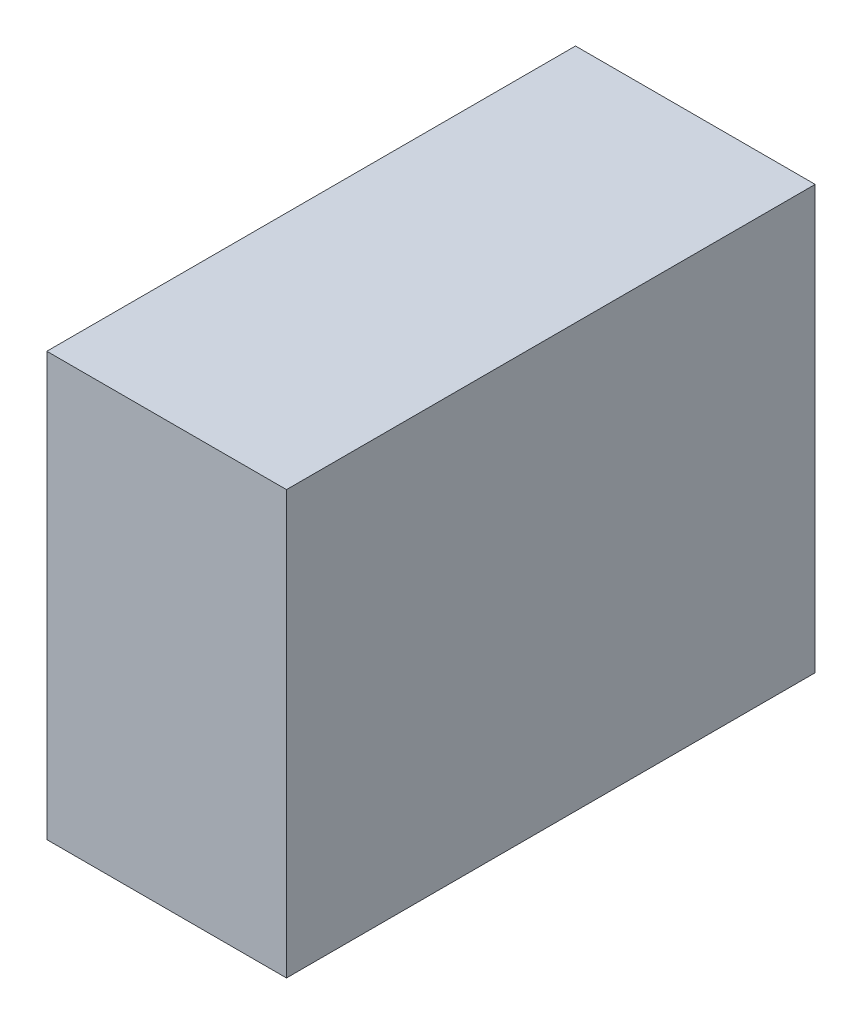
ISO-10303-21;
HEADER;
FILE_DESCRIPTION(('STEP AP214'),'2;1');
FILE_NAME('part.step','',(''),(''),'','','');
FILE_SCHEMA(('AUTOMOTIVE_DESIGN { 1 0 10303 214 1 1 1 1 }'));
ENDSEC;
DATA;
#1=APPLICATION_CONTEXT('core data for automotive mechanical design processes');
#2=APPLICATION_PROTOCOL_DEFINITION('international standard','automotive_design',2000,#1);
#3=PRODUCT_CONTEXT('',#1,'mechanical');
#4=PRODUCT('Part','Part','',(#3));
#5=PRODUCT_RELATED_PRODUCT_CATEGORY('part','',(#4));
#6=PRODUCT_DEFINITION_FORMATION('','',#4);
#7=PRODUCT_DEFINITION_CONTEXT('part definition',#1,'design');
#8=PRODUCT_DEFINITION('design','',#6,#7);
#9=PRODUCT_DEFINITION_SHAPE('','',#8);
#10=(LENGTH_UNIT() NAMED_UNIT(*) SI_UNIT(.MILLI.,.METRE.));
#11=(NAMED_UNIT(*) PLANE_ANGLE_UNIT() SI_UNIT($,.RADIAN.));
#12=(NAMED_UNIT(*) SI_UNIT($,.STERADIAN.) SOLID_ANGLE_UNIT());
#13=UNCERTAINTY_MEASURE_WITH_UNIT(LENGTH_MEASURE(1.E-05),#10,'distance_accuracy_value','');
#14=(GEOMETRIC_REPRESENTATION_CONTEXT(3) GLOBAL_UNCERTAINTY_ASSIGNED_CONTEXT((#13)) GLOBAL_UNIT_ASSIGNED_CONTEXT((#10,
#11,#12)) REPRESENTATION_CONTEXT('',''));
#15=CARTESIAN_POINT('',(0.,0.,0.));
#16=DIRECTION('',(0.,0.,1.));
#17=DIRECTION('',(1.,0.,0.));
#18=AXIS2_PLACEMENT_3D('',#15,#16,#17);
#19=CARTESIAN_POINT('',(0.,0.,150.));
#20=DIRECTION('',(1.,0.,0.));
#21=DIRECTION('',(0.,1.,0.));
#22=AXIS2_PLACEMENT_3D('',#19,#20,#21);
#23=PLANE('',#22);
#24=DIRECTION('',(0.,-1.,0.));
#25=VECTOR('',#24,1.);
#26=CARTESIAN_POINT('',(0.,0.,0.));
#27=LINE('',#26,#25);
#28=CARTESIAN_POINT('',(0.,120.,0.));
#29=VERTEX_POINT('',#28);
#30=CARTESIAN_POINT('',(0.,0.,0.));
#31=VERTEX_POINT('',#30);
#32=EDGE_CURVE('E96',#29,#31,#27,.T.);
#33=ORIENTED_EDGE('',*,*,#32,.T.);
#34=DIRECTION('',(0.,0.,-1.));
#35=VECTOR('',#34,1.);
#36=CARTESIAN_POINT('',(0.,0.,150.));
#37=LINE('',#36,#35);
#38=CARTESIAN_POINT('',(0.,0.,150.));
#39=VERTEX_POINT('',#38);
#40=EDGE_CURVE('E11',#39,#31,#37,.T.);
#41=ORIENTED_EDGE('',*,*,#40,.F.);
#42=DIRECTION('',(0.,-1.,0.));
#43=VECTOR('',#42,1.);
#44=CARTESIAN_POINT('',(0.,0.,150.));
#45=LINE('',#44,#43);
#46=CARTESIAN_POINT('',(0.,120.,150.));
#47=VERTEX_POINT('',#46);
#48=EDGE_CURVE('E84',#47,#39,#45,.T.);
#49=ORIENTED_EDGE('',*,*,#48,.F.);
#50=DIRECTION('',(0.,0.,-1.));
#51=VECTOR('',#50,1.);
#52=CARTESIAN_POINT('',(0.,120.,150.));
#53=LINE('',#52,#51);
#54=EDGE_CURVE('E92',#47,#29,#53,.T.);
#55=ORIENTED_EDGE('',*,*,#54,.T.);
#56=EDGE_LOOP('',(#33,#41,#49,#55));
#57=FACE_BOUND('',#56,.T.);
#58=ADVANCED_FACE('F33',(#57),#23,.F.);
#59=CARTESIAN_POINT('',(0.,0.,150.));
#60=DIRECTION('',(0.,1.,0.));
#61=DIRECTION('',(0.,0.,1.));
#62=AXIS2_PLACEMENT_3D('',#59,#60,#61);
#63=PLANE('',#62);
#64=DIRECTION('',(1.,0.,0.));
#65=VECTOR('',#64,1.);
#66=CARTESIAN_POINT('',(0.,0.,0.));
#67=LINE('',#66,#65);
#68=CARTESIAN_POINT('',(68.,0.,0.));
#69=VERTEX_POINT('',#68);
#70=EDGE_CURVE('E88',#31,#69,#67,.T.);
#71=ORIENTED_EDGE('',*,*,#70,.T.);
#72=DIRECTION('',(0.,0.,-1.));
#73=VECTOR('',#72,1.);
#74=CARTESIAN_POINT('',(68.,0.,150.));
#75=LINE('',#74,#73);
#76=CARTESIAN_POINT('',(68.,0.,150.));
#77=VERTEX_POINT('',#76);
#78=EDGE_CURVE('E41',#77,#69,#75,.T.);
#79=ORIENTED_EDGE('',*,*,#78,.F.);
#80=DIRECTION('',(1.,0.,0.));
#81=VECTOR('',#80,1.);
#82=CARTESIAN_POINT('',(0.,0.,150.));
#83=LINE('',#82,#81);
#84=EDGE_CURVE('E79',#39,#77,#83,.T.);
#85=ORIENTED_EDGE('',*,*,#84,.F.);
#86=ORIENTED_EDGE('',*,*,#40,.T.);
#87=EDGE_LOOP('',(#71,#79,#85,#86));
#88=FACE_BOUND('',#87,.T.);
#89=ADVANCED_FACE('F87',(#88),#63,.F.);
#90=CARTESIAN_POINT('',(68.,0.,150.));
#91=DIRECTION('',(-1.,0.,0.));
#92=DIRECTION('',(0.,-1.,0.));
#93=AXIS2_PLACEMENT_3D('',#90,#91,#92);
#94=PLANE('',#93);
#95=DIRECTION('',(0.,1.,0.));
#96=VECTOR('',#95,1.);
#97=CARTESIAN_POINT('',(68.,0.,0.));
#98=LINE('',#97,#96);
#99=CARTESIAN_POINT('',(68.,120.,0.));
#100=VERTEX_POINT('',#99);
#101=EDGE_CURVE('E66',#69,#100,#98,.T.);
#102=ORIENTED_EDGE('',*,*,#101,.T.);
#103=DIRECTION('',(0.,0.,-1.));
#104=VECTOR('',#103,1.);
#105=CARTESIAN_POINT('',(68.,120.,150.));
#106=LINE('',#105,#104);
#107=CARTESIAN_POINT('',(68.,120.,150.));
#108=VERTEX_POINT('',#107);
#109=EDGE_CURVE('E89',#108,#100,#106,.T.);
#110=ORIENTED_EDGE('',*,*,#109,.F.);
#111=DIRECTION('',(0.,1.,0.));
#112=VECTOR('',#111,1.);
#113=CARTESIAN_POINT('',(68.,0.,150.));
#114=LINE('',#113,#112);
#115=EDGE_CURVE('E82',#77,#108,#114,.T.);
#116=ORIENTED_EDGE('',*,*,#115,.F.);
#117=ORIENTED_EDGE('',*,*,#78,.T.);
#118=EDGE_LOOP('',(#102,#110,#116,#117));
#119=FACE_BOUND('',#118,.T.);
#120=ADVANCED_FACE('F90',(#119),#94,.F.);
#121=CARTESIAN_POINT('',(0.,120.,150.));
#122=DIRECTION('',(0.,-1.,0.));
#123=DIRECTION('',(0.,0.,-1.));
#124=AXIS2_PLACEMENT_3D('',#121,#122,#123);
#125=PLANE('',#124);
#126=DIRECTION('',(-1.,0.,0.));
#127=VECTOR('',#126,1.);
#128=CARTESIAN_POINT('',(0.,120.,0.));
#129=LINE('',#128,#127);
#130=EDGE_CURVE('E72',#100,#29,#129,.T.);
#131=ORIENTED_EDGE('',*,*,#130,.T.);
#132=ORIENTED_EDGE('',*,*,#54,.F.);
#133=DIRECTION('',(-1.,0.,0.));
#134=VECTOR('',#133,1.);
#135=CARTESIAN_POINT('',(0.,120.,150.));
#136=LINE('',#135,#134);
#137=EDGE_CURVE('E49',#108,#47,#136,.T.);
#138=ORIENTED_EDGE('',*,*,#137,.F.);
#139=ORIENTED_EDGE('',*,*,#109,.T.);
#140=EDGE_LOOP('',(#131,#132,#138,#139));
#141=FACE_BOUND('',#140,.T.);
#142=ADVANCED_FACE('F103',(#141),#125,.F.);
#143=CARTESIAN_POINT('',(0.,0.,150.));
#144=DIRECTION('',(0.,0.,-1.));
#145=DIRECTION('',(-1.,0.,0.));
#146=AXIS2_PLACEMENT_3D('',#143,#144,#145);
#147=PLANE('',#146);
#148=ORIENTED_EDGE('',*,*,#48,.T.);
#149=ORIENTED_EDGE('',*,*,#84,.T.);
#150=ORIENTED_EDGE('',*,*,#115,.T.);
#151=ORIENTED_EDGE('',*,*,#137,.T.);
#152=EDGE_LOOP('',(#148,#149,#150,#151));
#153=FACE_BOUND('',#152,.T.);
#154=ADVANCED_FACE('F80',(#153),#147,.F.);
#155=CARTESIAN_POINT('',(0.,0.,0.));
#156=DIRECTION('',(0.,0.,-1.));
#157=DIRECTION('',(-1.,0.,0.));
#158=AXIS2_PLACEMENT_3D('',#155,#156,#157);
#159=PLANE('',#158);
#160=ORIENTED_EDGE('',*,*,#32,.F.);
#161=ORIENTED_EDGE('',*,*,#130,.F.);
#162=ORIENTED_EDGE('',*,*,#101,.F.);
#163=ORIENTED_EDGE('',*,*,#70,.F.);
#164=EDGE_LOOP('',(#160,#161,#162,#163));
#165=FACE_BOUND('',#164,.T.);
#166=ADVANCED_FACE('F106',(#165),#159,.T.);
#167=CLOSED_SHELL('',(#58,#89,#120,#142,#154,#166));
#168=MANIFOLD_SOLID_BREP('B2',#167);
#169=ADVANCED_BREP_SHAPE_REPRESENTATION('',(#18,#168),#14);
#170=SHAPE_DEFINITION_REPRESENTATION(#9,#169);
ENDSEC;
END-ISO-10303-21;
